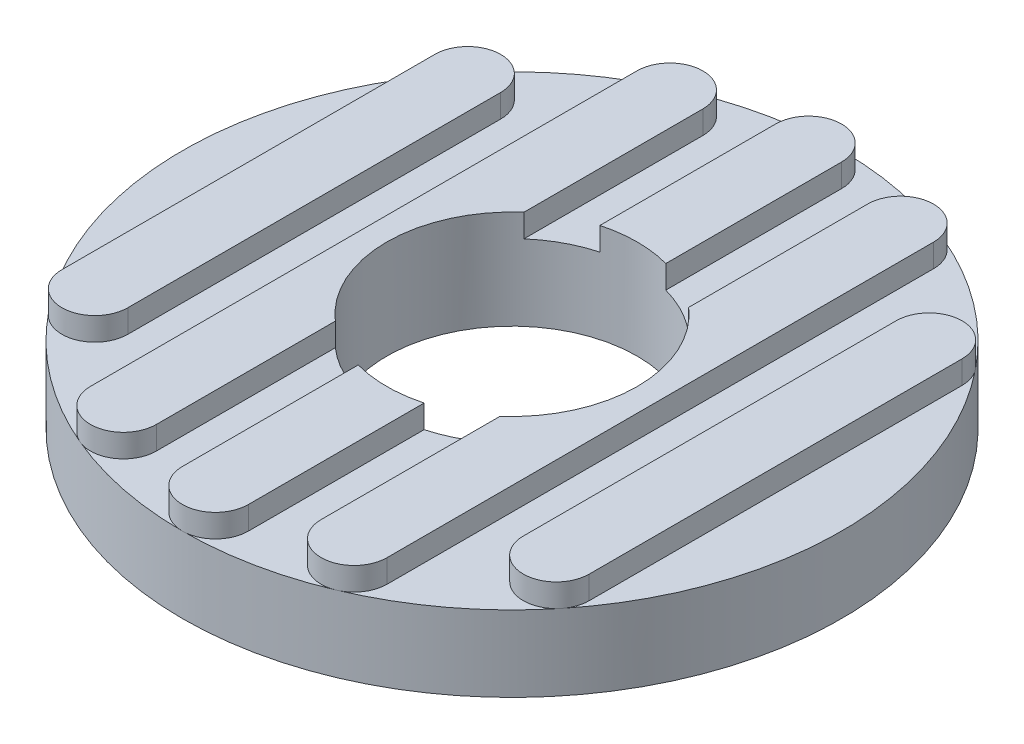
ISO-10303-21;
HEADER;
FILE_DESCRIPTION(('STEP AP214'),'2;1');
FILE_NAME('part.step','',(''),(''),'','','');
FILE_SCHEMA(('AUTOMOTIVE_DESIGN { 1 0 10303 214 1 1 1 1 }'));
ENDSEC;
DATA;
#1=APPLICATION_CONTEXT('core data for automotive mechanical design processes');
#2=APPLICATION_PROTOCOL_DEFINITION('international standard','automotive_design',2000,#1);
#3=PRODUCT_CONTEXT('',#1,'mechanical');
#4=PRODUCT('Part','Part','',(#3));
#5=PRODUCT_RELATED_PRODUCT_CATEGORY('part','',(#4));
#6=PRODUCT_DEFINITION_FORMATION('','',#4);
#7=PRODUCT_DEFINITION_CONTEXT('part definition',#1,'design');
#8=PRODUCT_DEFINITION('design','',#6,#7);
#9=PRODUCT_DEFINITION_SHAPE('','',#8);
#10=(LENGTH_UNIT() NAMED_UNIT(*) SI_UNIT(.MILLI.,.METRE.));
#11=(NAMED_UNIT(*) PLANE_ANGLE_UNIT() SI_UNIT($,.RADIAN.));
#12=(NAMED_UNIT(*) SI_UNIT($,.STERADIAN.) SOLID_ANGLE_UNIT());
#13=UNCERTAINTY_MEASURE_WITH_UNIT(LENGTH_MEASURE(1.E-05),#10,'distance_accuracy_value','');
#14=(GEOMETRIC_REPRESENTATION_CONTEXT(3) GLOBAL_UNCERTAINTY_ASSIGNED_CONTEXT((#13)) GLOBAL_UNIT_ASSIGNED_CONTEXT((#10,
#11,#12)) REPRESENTATION_CONTEXT('',''));
#15=CARTESIAN_POINT('',(0.,0.,0.));
#16=DIRECTION('',(0.,0.,1.));
#17=DIRECTION('',(1.,0.,0.));
#18=AXIS2_PLACEMENT_3D('',#15,#16,#17);
#19=CARTESIAN_POINT('',(0.,2.3,0.));
#20=DIRECTION('',(0.,1.,0.));
#21=DIRECTION('',(0.,0.,1.));
#22=AXIS2_PLACEMENT_3D('',#19,#20,#21);
#23=PLANE('',#22);
#24=CARTESIAN_POINT('',(0.,2.3,0.));
#25=DIRECTION('',(0.,1.,0.));
#26=DIRECTION('',(0.,0.,1.));
#27=AXIS2_PLACEMENT_3D('',#24,#25,#26);
#28=CIRCLE('',#27,3.8);
#29=CARTESIAN_POINT('',(1.,2.3,3.66606055596467));
#30=VERTEX_POINT('',#29);
#31=CARTESIAN_POINT('',(2.5,2.3,2.86181760425083));
#32=VERTEX_POINT('',#31);
#33=EDGE_CURVE('E348',#30,#32,#28,.T.);
#34=ORIENTED_EDGE('',*,*,#33,.F.);
#35=DIRECTION('',(0.,0.,-1.));
#36=VECTOR('',#35,1.);
#37=CARTESIAN_POINT('',(1.,2.3,9.));
#38=LINE('',#37,#36);
#39=CARTESIAN_POINT('',(1.,2.3,9.));
#40=VERTEX_POINT('',#39);
#41=EDGE_CURVE('E276',#40,#30,#38,.T.);
#42=ORIENTED_EDGE('',*,*,#41,.F.);
#43=CARTESIAN_POINT('',(0.,2.3,9.));
#44=DIRECTION('',(0.,1.,0.));
#45=DIRECTION('',(0.,0.,1.));
#46=AXIS2_PLACEMENT_3D('',#43,#44,#45);
#47=CIRCLE('',#46,1.);
#48=CARTESIAN_POINT('',(0.,2.3,10.));
#49=VERTEX_POINT('',#48);
#50=EDGE_CURVE('E275',#49,#40,#47,.T.);
#51=ORIENTED_EDGE('',*,*,#50,.F.);
#52=CARTESIAN_POINT('',(0.,2.3,0.));
#53=DIRECTION('',(0.,1.,0.));
#54=DIRECTION('',(0.,0.,1.));
#55=AXIS2_PLACEMENT_3D('',#52,#53,#54);
#56=CIRCLE('',#55,10.);
#57=CARTESIAN_POINT('',(3.88888888888889,2.3,9.21284663987611));
#58=VERTEX_POINT('',#57);
#59=EDGE_CURVE('E296',#49,#58,#56,.T.);
#60=ORIENTED_EDGE('',*,*,#59,.T.);
#61=CARTESIAN_POINT('',(3.5,2.3,8.2915619758885));
#62=DIRECTION('',(0.,1.,0.));
#63=DIRECTION('',(0.,0.,1.));
#64=AXIS2_PLACEMENT_3D('',#61,#62,#63);
#65=CIRCLE('',#64,1.);
#66=CARTESIAN_POINT('',(2.5,2.3,8.2915619758885));
#67=VERTEX_POINT('',#66);
#68=EDGE_CURVE('E427',#67,#58,#65,.T.);
#69=ORIENTED_EDGE('',*,*,#68,.F.);
#70=DIRECTION('',(0.,0.,1.));
#71=VECTOR('',#70,1.);
#72=CARTESIAN_POINT('',(2.5,2.3,8.2915619758885));
#73=LINE('',#72,#71);
#74=EDGE_CURVE('E434',#32,#67,#73,.T.);
#75=ORIENTED_EDGE('',*,*,#74,.F.);
#76=EDGE_LOOP('',(#34,#42,#51,#60,#69,#75));
#77=FACE_BOUND('',#76,.T.);
#78=ADVANCED_FACE('F17',(#77),#23,.T.);
#79=CARTESIAN_POINT('',(0.,2.3,0.));
#80=DIRECTION('',(0.,1.,0.));
#81=DIRECTION('',(0.,0.,1.));
#82=AXIS2_PLACEMENT_3D('',#79,#80,#81);
#83=CIRCLE('',#82,3.8);
#84=CARTESIAN_POINT('',(-1.,2.3,-3.66606055596467));
#85=VERTEX_POINT('',#84);
#86=CARTESIAN_POINT('',(-2.5,2.3,-2.86181760425083));
#87=VERTEX_POINT('',#86);
#88=EDGE_CURVE('E325',#85,#87,#83,.T.);
#89=ORIENTED_EDGE('',*,*,#88,.F.);
#90=DIRECTION('',(0.,0.,1.));
#91=VECTOR('',#90,1.);
#92=CARTESIAN_POINT('',(-1.,2.3,9.));
#93=LINE('',#92,#91);
#94=CARTESIAN_POINT('',(-1.,2.3,-9.));
#95=VERTEX_POINT('',#94);
#96=EDGE_CURVE('E262',#95,#85,#93,.T.);
#97=ORIENTED_EDGE('',*,*,#96,.F.);
#98=CARTESIAN_POINT('',(0.,2.3,-9.));
#99=DIRECTION('',(0.,1.,0.));
#100=DIRECTION('',(0.,0.,1.));
#101=AXIS2_PLACEMENT_3D('',#98,#99,#100);
#102=CIRCLE('',#101,1.);
#103=CARTESIAN_POINT('',(0.,2.3,-10.));
#104=VERTEX_POINT('',#103);
#105=EDGE_CURVE('E283',#104,#95,#102,.T.);
#106=ORIENTED_EDGE('',*,*,#105,.F.);
#107=CARTESIAN_POINT('',(-3.88888888888889,2.3,-9.21284663987611));
#108=VERTEX_POINT('',#107);
#109=EDGE_CURVE('E301',#104,#108,#56,.T.);
#110=ORIENTED_EDGE('',*,*,#109,.T.);
#111=CARTESIAN_POINT('',(-3.5,2.3,-8.2915619758885));
#112=DIRECTION('',(0.,1.,0.));
#113=DIRECTION('',(0.,0.,-1.));
#114=AXIS2_PLACEMENT_3D('',#111,#112,#113);
#115=CIRCLE('',#114,1.);
#116=CARTESIAN_POINT('',(-2.5,2.3,-8.2915619758885));
#117=VERTEX_POINT('',#116);
#118=EDGE_CURVE('E371',#117,#108,#115,.T.);
#119=ORIENTED_EDGE('',*,*,#118,.F.);
#120=DIRECTION('',(0.,0.,-1.));
#121=VECTOR('',#120,1.);
#122=CARTESIAN_POINT('',(-2.5,2.3,8.2915619758885));
#123=LINE('',#122,#121);
#124=EDGE_CURVE('E367',#87,#117,#123,.T.);
#125=ORIENTED_EDGE('',*,*,#124,.F.);
#126=EDGE_LOOP('',(#89,#97,#106,#110,#119,#125));
#127=FACE_BOUND('',#126,.T.);
#128=ADVANCED_FACE('F529',(#127),#23,.T.);
#129=CARTESIAN_POINT('',(1.,3.,9.));
#130=DIRECTION('',(-1.,0.,0.));
#131=DIRECTION('',(0.,0.,1.));
#132=AXIS2_PLACEMENT_3D('',#129,#130,#131);
#133=PLANE('',#132);
#134=DIRECTION('',(0.,0.,-1.));
#135=VECTOR('',#134,1.);
#136=CARTESIAN_POINT('',(1.,3.,9.));
#137=LINE('',#136,#135);
#138=CARTESIAN_POINT('',(1.,3.,-3.66606055596467));
#139=VERTEX_POINT('',#138);
#140=CARTESIAN_POINT('',(1.,3.,-9.));
#141=VERTEX_POINT('',#140);
#142=EDGE_CURVE('E244',#139,#141,#137,.T.);
#143=ORIENTED_EDGE('',*,*,#142,.F.);
#144=DIRECTION('',(0.,-1.,0.));
#145=VECTOR('',#144,1.);
#146=CARTESIAN_POINT('',(1.,0.,-3.66606055596467));
#147=LINE('',#146,#145);
#148=CARTESIAN_POINT('',(1.,2.3,-3.66606055596467));
#149=VERTEX_POINT('',#148);
#150=EDGE_CURVE('E229',#139,#149,#147,.T.);
#151=ORIENTED_EDGE('',*,*,#150,.T.);
#152=CARTESIAN_POINT('',(1.,2.3,-9.));
#153=VERTEX_POINT('',#152);
#154=EDGE_CURVE('E273',#149,#153,#38,.T.);
#155=ORIENTED_EDGE('',*,*,#154,.T.);
#156=DIRECTION('',(0.,-1.,0.));
#157=VECTOR('',#156,1.);
#158=CARTESIAN_POINT('',(1.,3.,-9.));
#159=LINE('',#158,#157);
#160=EDGE_CURVE('E254',#141,#153,#159,.T.);
#161=ORIENTED_EDGE('',*,*,#160,.F.);
#162=EDGE_LOOP('',(#143,#151,#155,#161));
#163=FACE_BOUND('',#162,.T.);
#164=ADVANCED_FACE('F252',(#163),#133,.F.);
#165=CARTESIAN_POINT('',(-1.,3.,9.));
#166=DIRECTION('',(1.,0.,0.));
#167=DIRECTION('',(0.,0.,-1.));
#168=AXIS2_PLACEMENT_3D('',#165,#166,#167);
#169=PLANE('',#168);
#170=DIRECTION('',(0.,0.,1.));
#171=VECTOR('',#170,1.);
#172=CARTESIAN_POINT('',(-1.,3.,9.));
#173=LINE('',#172,#171);
#174=CARTESIAN_POINT('',(-1.,3.,3.66606055596467));
#175=VERTEX_POINT('',#174);
#176=CARTESIAN_POINT('',(-1.,3.,9.));
#177=VERTEX_POINT('',#176);
#178=EDGE_CURVE('E267',#175,#177,#173,.T.);
#179=ORIENTED_EDGE('',*,*,#178,.F.);
#180=DIRECTION('',(0.,-1.,0.));
#181=VECTOR('',#180,1.);
#182=CARTESIAN_POINT('',(-1.,0.,3.66606055596467));
#183=LINE('',#182,#181);
#184=CARTESIAN_POINT('',(-1.,2.3,3.66606055596467));
#185=VERTEX_POINT('',#184);
#186=EDGE_CURVE('E324',#175,#185,#183,.T.);
#187=ORIENTED_EDGE('',*,*,#186,.T.);
#188=CARTESIAN_POINT('',(-1.,2.3,9.));
#189=VERTEX_POINT('',#188);
#190=EDGE_CURVE('E282',#185,#189,#93,.T.);
#191=ORIENTED_EDGE('',*,*,#190,.T.);
#192=DIRECTION('',(0.,-1.,0.));
#193=VECTOR('',#192,1.);
#194=CARTESIAN_POINT('',(-1.,3.,9.));
#195=LINE('',#194,#193);
#196=EDGE_CURVE('E269',#177,#189,#195,.T.);
#197=ORIENTED_EDGE('',*,*,#196,.F.);
#198=EDGE_LOOP('',(#179,#187,#191,#197));
#199=FACE_BOUND('',#198,.T.);
#200=ADVANCED_FACE('F334',(#199),#169,.F.);
#201=CARTESIAN_POINT('',(0.,3.,9.));
#202=DIRECTION('',(0.,1.,0.));
#203=DIRECTION('',(0.,0.,1.));
#204=AXIS2_PLACEMENT_3D('',#201,#202,#203);
#205=PLANE('',#204);
#206=CARTESIAN_POINT('',(1.,3.,9.));
#207=VERTEX_POINT('',#206);
#208=CARTESIAN_POINT('',(1.,3.,3.66606055596467));
#209=VERTEX_POINT('',#208);
#210=EDGE_CURVE('E256',#207,#209,#137,.T.);
#211=ORIENTED_EDGE('',*,*,#210,.T.);
#212=CARTESIAN_POINT('',(0.,3.,0.));
#213=DIRECTION('',(0.,-1.,0.));
#214=DIRECTION('',(0.,0.,-1.));
#215=AXIS2_PLACEMENT_3D('',#212,#213,#214);
#216=CIRCLE('',#215,3.8);
#217=EDGE_CURVE('E248',#209,#175,#216,.T.);
#218=ORIENTED_EDGE('',*,*,#217,.T.);
#219=ORIENTED_EDGE('',*,*,#178,.T.);
#220=CARTESIAN_POINT('',(0.,3.,9.));
#221=DIRECTION('',(0.,1.,0.));
#222=DIRECTION('',(0.,0.,1.));
#223=AXIS2_PLACEMENT_3D('',#220,#221,#222);
#224=CIRCLE('',#223,1.);
#225=EDGE_CURVE('E257',#177,#207,#224,.T.);
#226=ORIENTED_EDGE('',*,*,#225,.T.);
#227=EDGE_LOOP('',(#211,#218,#219,#226));
#228=FACE_BOUND('',#227,.T.);
#229=ADVANCED_FACE('F329',(#228),#205,.T.);
#230=CARTESIAN_POINT('',(-1.,3.,-9.));
#231=VERTEX_POINT('',#230);
#232=CARTESIAN_POINT('',(-1.,3.,-3.66606055596467));
#233=VERTEX_POINT('',#232);
#234=EDGE_CURVE('E247',#231,#233,#173,.T.);
#235=ORIENTED_EDGE('',*,*,#234,.T.);
#236=EDGE_CURVE('E232',#233,#139,#216,.T.);
#237=ORIENTED_EDGE('',*,*,#236,.T.);
#238=ORIENTED_EDGE('',*,*,#142,.T.);
#239=CARTESIAN_POINT('',(0.,3.,-9.));
#240=DIRECTION('',(0.,1.,0.));
#241=DIRECTION('',(0.,0.,1.));
#242=AXIS2_PLACEMENT_3D('',#239,#240,#241);
#243=CIRCLE('',#242,1.);
#244=EDGE_CURVE('E260',#141,#231,#243,.T.);
#245=ORIENTED_EDGE('',*,*,#244,.T.);
#246=EDGE_LOOP('',(#235,#237,#238,#245));
#247=FACE_BOUND('',#246,.T.);
#248=ADVANCED_FACE('F243',(#247),#205,.T.);
#249=CARTESIAN_POINT('',(3.5,3.,8.2915619758885));
#250=DIRECTION('',(0.,1.,0.));
#251=DIRECTION('',(0.,0.,1.));
#252=AXIS2_PLACEMENT_3D('',#249,#250,#251);
#253=PLANE('',#252);
#254=DIRECTION('',(0.,0.,1.));
#255=VECTOR('',#254,1.);
#256=CARTESIAN_POINT('',(2.5,3.,8.2915619758885));
#257=LINE('',#256,#255);
#258=CARTESIAN_POINT('',(2.5,3.,-8.2915619758885));
#259=VERTEX_POINT('',#258);
#260=CARTESIAN_POINT('',(2.5,3.,-2.86181760425083));
#261=VERTEX_POINT('',#260);
#262=EDGE_CURVE('E424',#259,#261,#257,.T.);
#263=ORIENTED_EDGE('',*,*,#262,.T.);
#264=CARTESIAN_POINT('',(2.5,3.,2.86181760425083));
#265=VERTEX_POINT('',#264);
#266=EDGE_CURVE('E314',#261,#265,#216,.T.);
#267=ORIENTED_EDGE('',*,*,#266,.T.);
#268=CARTESIAN_POINT('',(2.5,3.,8.2915619758885));
#269=VERTEX_POINT('',#268);
#270=EDGE_CURVE('E423',#265,#269,#257,.T.);
#271=ORIENTED_EDGE('',*,*,#270,.T.);
#272=CARTESIAN_POINT('',(3.5,3.,8.2915619758885));
#273=DIRECTION('',(0.,1.,0.));
#274=DIRECTION('',(0.,0.,1.));
#275=AXIS2_PLACEMENT_3D('',#272,#273,#274);
#276=CIRCLE('',#275,1.);
#277=CARTESIAN_POINT('',(4.5,3.,8.2915619758885));
#278=VERTEX_POINT('',#277);
#279=EDGE_CURVE('E415',#269,#278,#276,.T.);
#280=ORIENTED_EDGE('',*,*,#279,.T.);
#281=DIRECTION('',(0.,0.,-1.));
#282=VECTOR('',#281,1.);
#283=CARTESIAN_POINT('',(4.5,3.,8.2915619758885));
#284=LINE('',#283,#282);
#285=CARTESIAN_POINT('',(4.5,3.,-8.2915619758885));
#286=VERTEX_POINT('',#285);
#287=EDGE_CURVE('E418',#278,#286,#284,.T.);
#288=ORIENTED_EDGE('',*,*,#287,.T.);
#289=CARTESIAN_POINT('',(3.5,3.,-8.2915619758885));
#290=DIRECTION('',(0.,1.,0.));
#291=DIRECTION('',(0.,0.,1.));
#292=AXIS2_PLACEMENT_3D('',#289,#290,#291);
#293=CIRCLE('',#292,1.);
#294=EDGE_CURVE('E421',#286,#259,#293,.T.);
#295=ORIENTED_EDGE('',*,*,#294,.T.);
#296=EDGE_LOOP('',(#263,#267,#271,#280,#288,#295));
#297=FACE_BOUND('',#296,.T.);
#298=ADVANCED_FACE('F615',(#297),#253,.T.);
#299=CARTESIAN_POINT('',(2.5,3.,8.2915619758885));
#300=DIRECTION('',(1.,0.,0.));
#301=DIRECTION('',(0.,0.,-1.));
#302=AXIS2_PLACEMENT_3D('',#299,#300,#301);
#303=PLANE('',#302);
#304=ORIENTED_EDGE('',*,*,#270,.F.);
#305=DIRECTION('',(0.,-1.,0.));
#306=VECTOR('',#305,1.);
#307=CARTESIAN_POINT('',(2.5,0.,2.86181760425083));
#308=LINE('',#307,#306);
#309=EDGE_CURVE('E239',#265,#32,#308,.T.);
#310=ORIENTED_EDGE('',*,*,#309,.T.);
#311=ORIENTED_EDGE('',*,*,#74,.T.);
#312=DIRECTION('',(0.,-1.,0.));
#313=VECTOR('',#312,1.);
#314=CARTESIAN_POINT('',(2.5,3.,8.2915619758885));
#315=LINE('',#314,#313);
#316=EDGE_CURVE('E426',#269,#67,#315,.T.);
#317=ORIENTED_EDGE('',*,*,#316,.F.);
#318=EDGE_LOOP('',(#304,#310,#311,#317));
#319=FACE_BOUND('',#318,.T.);
#320=ADVANCED_FACE('F612',(#319),#303,.F.);
#321=CARTESIAN_POINT('',(-2.5,3.,8.2915619758885));
#322=DIRECTION('',(-1.,0.,0.));
#323=DIRECTION('',(0.,0.,1.));
#324=AXIS2_PLACEMENT_3D('',#321,#322,#323);
#325=PLANE('',#324);
#326=DIRECTION('',(0.,0.,-1.));
#327=VECTOR('',#326,1.);
#328=CARTESIAN_POINT('',(-2.5,3.,8.2915619758885));
#329=LINE('',#328,#327);
#330=CARTESIAN_POINT('',(-2.5,3.,-2.86181760425083));
#331=VERTEX_POINT('',#330);
#332=CARTESIAN_POINT('',(-2.5,3.,-8.2915619758885));
#333=VERTEX_POINT('',#332);
#334=EDGE_CURVE('E358',#331,#333,#329,.T.);
#335=ORIENTED_EDGE('',*,*,#334,.F.);
#336=DIRECTION('',(0.,-1.,0.));
#337=VECTOR('',#336,1.);
#338=CARTESIAN_POINT('',(-2.5,0.,-2.86181760425083));
#339=LINE('',#338,#337);
#340=EDGE_CURVE('E11',#331,#87,#339,.T.);
#341=ORIENTED_EDGE('',*,*,#340,.T.);
#342=ORIENTED_EDGE('',*,*,#124,.T.);
#343=DIRECTION('',(0.,-1.,0.));
#344=VECTOR('',#343,1.);
#345=CARTESIAN_POINT('',(-2.5,3.,-8.2915619758885));
#346=LINE('',#345,#344);
#347=EDGE_CURVE('E377',#333,#117,#346,.T.);
#348=ORIENTED_EDGE('',*,*,#347,.F.);
#349=EDGE_LOOP('',(#335,#341,#342,#348));
#350=FACE_BOUND('',#349,.T.);
#351=ADVANCED_FACE('F581',(#350),#325,.F.);
#352=CARTESIAN_POINT('',(-2.5,2.3,2.86181760425084));
#353=VERTEX_POINT('',#352);
#354=EDGE_CURVE('E320',#353,#185,#83,.T.);
#355=ORIENTED_EDGE('',*,*,#354,.F.);
#356=CARTESIAN_POINT('',(-2.5,2.3,8.2915619758885));
#357=VERTEX_POINT('',#356);
#358=EDGE_CURVE('E368',#357,#353,#123,.T.);
#359=ORIENTED_EDGE('',*,*,#358,.F.);
#360=CARTESIAN_POINT('',(-3.5,2.3,8.2915619758885));
#361=DIRECTION('',(0.,1.,0.));
#362=DIRECTION('',(0.,0.,-1.));
#363=AXIS2_PLACEMENT_3D('',#360,#361,#362);
#364=CIRCLE('',#363,1.);
#365=CARTESIAN_POINT('',(-3.88888888888888,2.3,9.21284663987611));
#366=VERTEX_POINT('',#365);
#367=EDGE_CURVE('E347',#366,#357,#364,.T.);
#368=ORIENTED_EDGE('',*,*,#367,.F.);
#369=EDGE_CURVE('E304',#366,#49,#56,.T.);
#370=ORIENTED_EDGE('',*,*,#369,.T.);
#371=EDGE_CURVE('E270',#189,#49,#47,.T.);
#372=ORIENTED_EDGE('',*,*,#371,.F.);
#373=ORIENTED_EDGE('',*,*,#190,.F.);
#374=EDGE_LOOP('',(#355,#359,#368,#370,#372,#373));
#375=FACE_BOUND('',#374,.T.);
#376=ADVANCED_FACE('F536',(#375),#23,.T.);
#377=CARTESIAN_POINT('',(-7.77777777777777,2.3,6.28539361054709));
#378=VERTEX_POINT('',#377);
#379=EDGE_CURVE('E607',#378,#366,#56,.T.);
#380=ORIENTED_EDGE('',*,*,#379,.T.);
#381=CARTESIAN_POINT('',(-4.5,2.3,8.2915619758885));
#382=VERTEX_POINT('',#381);
#383=EDGE_CURVE('E350',#382,#366,#364,.T.);
#384=ORIENTED_EDGE('',*,*,#383,.F.);
#385=DIRECTION('',(0.,0.,1.));
#386=VECTOR('',#385,1.);
#387=CARTESIAN_POINT('',(-4.5,2.3,8.2915619758885));
#388=LINE('',#387,#386);
#389=CARTESIAN_POINT('',(-4.5,2.3,-8.2915619758885));
#390=VERTEX_POINT('',#389);
#391=EDGE_CURVE('E359',#390,#382,#388,.T.);
#392=ORIENTED_EDGE('',*,*,#391,.F.);
#393=EDGE_CURVE('E370',#108,#390,#115,.T.);
#394=ORIENTED_EDGE('',*,*,#393,.F.);
#395=CARTESIAN_POINT('',(-7.77777777777778,2.3,-6.28539361054709));
#396=VERTEX_POINT('',#395);
#397=EDGE_CURVE('E300',#108,#396,#56,.T.);
#398=ORIENTED_EDGE('',*,*,#397,.T.);
#399=CARTESIAN_POINT('',(-7.,2.3,-5.65685424949238));
#400=DIRECTION('',(0.,1.,0.));
#401=DIRECTION('',(0.,0.,-1.));
#402=AXIS2_PLACEMENT_3D('',#399,#400,#401);
#403=CIRCLE('',#402,1.);
#404=CARTESIAN_POINT('',(-6.,2.3,-5.65685424949238));
#405=VERTEX_POINT('',#404);
#406=EDGE_CURVE('E400',#405,#396,#403,.T.);
#407=ORIENTED_EDGE('',*,*,#406,.F.);
#408=DIRECTION('',(0.,0.,-1.));
#409=VECTOR('',#408,1.);
#410=CARTESIAN_POINT('',(-6.,2.3,5.65685424949238));
#411=LINE('',#410,#409);
#412=CARTESIAN_POINT('',(-6.,2.3,5.65685424949238));
#413=VERTEX_POINT('',#412);
#414=EDGE_CURVE('E397',#413,#405,#411,.T.);
#415=ORIENTED_EDGE('',*,*,#414,.F.);
#416=CARTESIAN_POINT('',(-7.,2.3,5.65685424949238));
#417=DIRECTION('',(0.,1.,0.));
#418=DIRECTION('',(0.,0.,-1.));
#419=AXIS2_PLACEMENT_3D('',#416,#417,#418);
#420=CIRCLE('',#419,1.);
#421=EDGE_CURVE('E383',#378,#413,#420,.T.);
#422=ORIENTED_EDGE('',*,*,#421,.F.);
#423=EDGE_LOOP('',(#380,#384,#392,#394,#398,#407,#415,#422));
#424=FACE_BOUND('',#423,.T.);
#425=ADVANCED_FACE('F590',(#424),#23,.T.);
#426=EDGE_CURVE('E506',#396,#378,#56,.T.);
#427=ORIENTED_EDGE('',*,*,#426,.T.);
#428=CARTESIAN_POINT('',(-8.,2.3,5.65685424949238));
#429=VERTEX_POINT('',#428);
#430=EDGE_CURVE('E395',#429,#378,#420,.T.);
#431=ORIENTED_EDGE('',*,*,#430,.F.);
#432=DIRECTION('',(0.,0.,1.));
#433=VECTOR('',#432,1.);
#434=CARTESIAN_POINT('',(-8.,2.3,5.65685424949238));
#435=LINE('',#434,#433);
#436=CARTESIAN_POINT('',(-8.,2.3,-5.65685424949238));
#437=VERTEX_POINT('',#436);
#438=EDGE_CURVE('E388',#437,#429,#435,.T.);
#439=ORIENTED_EDGE('',*,*,#438,.F.);
#440=EDGE_CURVE('E399',#396,#437,#403,.T.);
#441=ORIENTED_EDGE('',*,*,#440,.F.);
#442=EDGE_LOOP('',(#427,#431,#439,#441));
#443=FACE_BOUND('',#442,.T.);
#444=ADVANCED_FACE('F549',(#443),#23,.T.);
#445=CARTESIAN_POINT('',(3.5,2.3,-8.2915619758885));
#446=DIRECTION('',(0.,1.,0.));
#447=DIRECTION('',(0.,0.,1.));
#448=AXIS2_PLACEMENT_3D('',#445,#446,#447);
#449=CIRCLE('',#448,1.);
#450=CARTESIAN_POINT('',(4.5,2.3,-8.2915619758885));
#451=VERTEX_POINT('',#450);
#452=CARTESIAN_POINT('',(3.88888888888889,2.3,-9.21284663987611));
#453=VERTEX_POINT('',#452);
#454=EDGE_CURVE('E432',#451,#453,#449,.T.);
#455=ORIENTED_EDGE('',*,*,#454,.F.);
#456=DIRECTION('',(0.,0.,-1.));
#457=VECTOR('',#456,1.);
#458=CARTESIAN_POINT('',(4.5,2.3,8.2915619758885));
#459=LINE('',#458,#457);
#460=CARTESIAN_POINT('',(4.5,2.3,8.2915619758885));
#461=VERTEX_POINT('',#460);
#462=EDGE_CURVE('E429',#461,#451,#459,.T.);
#463=ORIENTED_EDGE('',*,*,#462,.F.);
#464=EDGE_CURVE('E414',#58,#461,#65,.T.);
#465=ORIENTED_EDGE('',*,*,#464,.F.);
#466=CARTESIAN_POINT('',(7.77777777777778,2.3,6.28539361054709));
#467=VERTEX_POINT('',#466);
#468=EDGE_CURVE('E299',#58,#467,#56,.T.);
#469=ORIENTED_EDGE('',*,*,#468,.T.);
#470=CARTESIAN_POINT('',(7.,2.3,5.65685424949238));
#471=DIRECTION('',(0.,1.,0.));
#472=DIRECTION('',(0.,0.,1.));
#473=AXIS2_PLACEMENT_3D('',#470,#471,#472);
#474=CIRCLE('',#473,1.);
#475=CARTESIAN_POINT('',(6.,2.3,5.65685424949238));
#476=VERTEX_POINT('',#475);
#477=EDGE_CURVE('E447',#476,#467,#474,.T.);
#478=ORIENTED_EDGE('',*,*,#477,.F.);
#479=DIRECTION('',(0.,0.,1.));
#480=VECTOR('',#479,1.);
#481=CARTESIAN_POINT('',(6.,2.3,5.65685424949238));
#482=LINE('',#481,#480);
#483=CARTESIAN_POINT('',(6.,2.3,-5.65685424949238));
#484=VERTEX_POINT('',#483);
#485=EDGE_CURVE('E452',#484,#476,#482,.T.);
#486=ORIENTED_EDGE('',*,*,#485,.F.);
#487=CARTESIAN_POINT('',(7.,2.3,-5.65685424949238));
#488=DIRECTION('',(0.,1.,0.));
#489=DIRECTION('',(0.,0.,1.));
#490=AXIS2_PLACEMENT_3D('',#487,#488,#489);
#491=CIRCLE('',#490,1.);
#492=CARTESIAN_POINT('',(7.77777777777778,2.3,-6.28539361054709));
#493=VERTEX_POINT('',#492);
#494=EDGE_CURVE('E305',#484,#493,#491,.F.);
#495=ORIENTED_EDGE('',*,*,#494,.T.);
#496=EDGE_CURVE('E497',#493,#453,#56,.T.);
#497=ORIENTED_EDGE('',*,*,#496,.T.);
#498=EDGE_LOOP('',(#455,#463,#465,#469,#478,#486,#495,#497));
#499=FACE_BOUND('',#498,.T.);
#500=ADVANCED_FACE('F496',(#499),#23,.T.);
#501=CARTESIAN_POINT('',(2.5,2.3,-2.86181760425083));
#502=VERTEX_POINT('',#501);
#503=EDGE_CURVE('E235',#502,#149,#28,.T.);
#504=ORIENTED_EDGE('',*,*,#503,.F.);
#505=CARTESIAN_POINT('',(2.5,2.3,-8.2915619758885));
#506=VERTEX_POINT('',#505);
#507=EDGE_CURVE('E419',#506,#502,#73,.T.);
#508=ORIENTED_EDGE('',*,*,#507,.F.);
#509=EDGE_CURVE('E431',#453,#506,#449,.T.);
#510=ORIENTED_EDGE('',*,*,#509,.F.);
#511=EDGE_CURVE('E505',#453,#104,#56,.T.);
#512=ORIENTED_EDGE('',*,*,#511,.T.);
#513=EDGE_CURVE('E279',#153,#104,#102,.T.);
#514=ORIENTED_EDGE('',*,*,#513,.F.);
#515=ORIENTED_EDGE('',*,*,#154,.F.);
#516=EDGE_LOOP('',(#504,#508,#510,#512,#514,#515));
#517=FACE_BOUND('',#516,.T.);
#518=ADVANCED_FACE('F539',(#517),#23,.T.);
#519=CARTESIAN_POINT('',(7.,2.3,-5.65685424949238));
#520=DIRECTION('',(0.,1.,0.));
#521=DIRECTION('',(0.,0.,1.));
#522=AXIS2_PLACEMENT_3D('',#519,#520,#521);
#523=CIRCLE('',#522,1.);
#524=CARTESIAN_POINT('',(8.,2.3,-5.65685424949238));
#525=VERTEX_POINT('',#524);
#526=EDGE_CURVE('E463',#525,#493,#523,.T.);
#527=ORIENTED_EDGE('',*,*,#526,.F.);
#528=DIRECTION('',(0.,0.,-1.));
#529=VECTOR('',#528,1.);
#530=CARTESIAN_POINT('',(8.,2.3,5.65685424949238));
#531=LINE('',#530,#529);
#532=CARTESIAN_POINT('',(8.,2.3,5.65685424949238));
#533=VERTEX_POINT('',#532);
#534=EDGE_CURVE('E461',#533,#525,#531,.T.);
#535=ORIENTED_EDGE('',*,*,#534,.F.);
#536=CARTESIAN_POINT('',(7.,2.3,5.65685424949238));
#537=DIRECTION('',(0.,1.,0.));
#538=DIRECTION('',(0.,0.,1.));
#539=AXIS2_PLACEMENT_3D('',#536,#537,#538);
#540=CIRCLE('',#539,1.);
#541=EDGE_CURVE('E308',#533,#467,#540,.F.);
#542=ORIENTED_EDGE('',*,*,#541,.T.);
#543=EDGE_CURVE('E485',#467,#493,#56,.T.);
#544=ORIENTED_EDGE('',*,*,#543,.T.);
#545=EDGE_LOOP('',(#527,#535,#542,#544));
#546=FACE_BOUND('',#545,.T.);
#547=ADVANCED_FACE('F482',(#546),#23,.T.);
#548=CARTESIAN_POINT('',(0.,2.3,0.));
#549=DIRECTION('',(0.,-1.,0.));
#550=DIRECTION('',(0.,0.,-1.));
#551=AXIS2_PLACEMENT_3D('',#548,#549,#550);
#552=CYLINDRICAL_SURFACE('',#551,10.);
#553=ORIENTED_EDGE('',*,*,#59,.F.);
#554=ORIENTED_EDGE('',*,*,#369,.F.);
#555=ORIENTED_EDGE('',*,*,#379,.F.);
#556=ORIENTED_EDGE('',*,*,#426,.F.);
#557=ORIENTED_EDGE('',*,*,#397,.F.);
#558=ORIENTED_EDGE('',*,*,#109,.F.);
#559=ORIENTED_EDGE('',*,*,#511,.F.);
#560=ORIENTED_EDGE('',*,*,#496,.F.);
#561=ORIENTED_EDGE('',*,*,#543,.F.);
#562=ORIENTED_EDGE('',*,*,#468,.F.);
#563=EDGE_LOOP('',(#553,#554,#555,#556,#557,#558,#559,#560,#561,#562));
#564=FACE_BOUND('',#563,.T.);
#565=CARTESIAN_POINT('',(0.,0.,0.));
#566=DIRECTION('',(0.,1.,0.));
#567=DIRECTION('',(0.,0.,1.));
#568=AXIS2_PLACEMENT_3D('',#565,#566,#567);
#569=CIRCLE('',#568,10.);
#570=CARTESIAN_POINT('',(0.,0.,10.));
#571=VERTEX_POINT('',#570);
#572=EDGE_CURVE('E295',#571,#571,#569,.T.);
#573=ORIENTED_EDGE('',*,*,#572,.T.);
#574=EDGE_LOOP('',(#573));
#575=FACE_BOUND('',#574,.T.);
#576=ADVANCED_FACE('F19',(#564,#575),#552,.T.);
#577=CARTESIAN_POINT('',(0.,0.,0.));
#578=DIRECTION('',(0.,1.,0.));
#579=DIRECTION('',(0.,0.,1.));
#580=AXIS2_PLACEMENT_3D('',#577,#578,#579);
#581=PLANE('',#580);
#582=CARTESIAN_POINT('',(0.,0.,0.));
#583=DIRECTION('',(0.,-1.,0.));
#584=DIRECTION('',(0.,0.,-1.));
#585=AXIS2_PLACEMENT_3D('',#582,#583,#584);
#586=CIRCLE('',#585,3.8);
#587=CARTESIAN_POINT('',(0.,0.,-3.8));
#588=VERTEX_POINT('',#587);
#589=EDGE_CURVE('E249',#588,#588,#586,.T.);
#590=ORIENTED_EDGE('',*,*,#589,.F.);
#591=EDGE_LOOP('',(#590));
#592=FACE_BOUND('',#591,.T.);
#593=ORIENTED_EDGE('',*,*,#572,.F.);
#594=EDGE_LOOP('',(#593));
#595=FACE_BOUND('',#594,.T.);
#596=ADVANCED_FACE('F544',(#592,#595),#581,.F.);
#597=CARTESIAN_POINT('',(0.,3.,9.));
#598=DIRECTION('',(0.,-1.,0.));
#599=DIRECTION('',(0.,0.,-1.));
#600=AXIS2_PLACEMENT_3D('',#597,#598,#599);
#601=CYLINDRICAL_SURFACE('',#600,1.);
#602=ORIENTED_EDGE('',*,*,#371,.T.);
#603=ORIENTED_EDGE('',*,*,#50,.T.);
#604=DIRECTION('',(0.,-1.,0.));
#605=VECTOR('',#604,1.);
#606=CARTESIAN_POINT('',(1.,3.,9.));
#607=LINE('',#606,#605);
#608=EDGE_CURVE('E292',#207,#40,#607,.T.);
#609=ORIENTED_EDGE('',*,*,#608,.F.);
#610=ORIENTED_EDGE('',*,*,#225,.F.);
#611=ORIENTED_EDGE('',*,*,#196,.T.);
#612=EDGE_LOOP('',(#602,#603,#609,#610,#611));
#613=FACE_BOUND('',#612,.T.);
#614=ADVANCED_FACE('F340',(#613),#601,.T.);
#615=ORIENTED_EDGE('',*,*,#41,.T.);
#616=DIRECTION('',(0.,-1.,0.));
#617=VECTOR('',#616,1.);
#618=CARTESIAN_POINT('',(1.,0.,3.66606055596467));
#619=LINE('',#618,#617);
#620=EDGE_CURVE('E345',#30,#209,#619,.F.);
#621=ORIENTED_EDGE('',*,*,#620,.T.);
#622=ORIENTED_EDGE('',*,*,#210,.F.);
#623=ORIENTED_EDGE('',*,*,#608,.T.);
#624=EDGE_LOOP('',(#615,#621,#622,#623));
#625=FACE_BOUND('',#624,.T.);
#626=ADVANCED_FACE('F344',(#625),#133,.F.);
#627=CARTESIAN_POINT('',(0.,3.,-9.));
#628=DIRECTION('',(0.,-1.,0.));
#629=DIRECTION('',(0.,0.,-1.));
#630=AXIS2_PLACEMENT_3D('',#627,#628,#629);
#631=CYLINDRICAL_SURFACE('',#630,1.);
#632=ORIENTED_EDGE('',*,*,#513,.T.);
#633=ORIENTED_EDGE('',*,*,#105,.T.);
#634=DIRECTION('',(0.,-1.,0.));
#635=VECTOR('',#634,1.);
#636=CARTESIAN_POINT('',(-1.,3.,-9.));
#637=LINE('',#636,#635);
#638=EDGE_CURVE('E288',#231,#95,#637,.T.);
#639=ORIENTED_EDGE('',*,*,#638,.F.);
#640=ORIENTED_EDGE('',*,*,#244,.F.);
#641=ORIENTED_EDGE('',*,*,#160,.T.);
#642=EDGE_LOOP('',(#632,#633,#639,#640,#641));
#643=FACE_BOUND('',#642,.T.);
#644=ADVANCED_FACE('F572',(#643),#631,.T.);
#645=ORIENTED_EDGE('',*,*,#96,.T.);
#646=DIRECTION('',(0.,-1.,0.));
#647=VECTOR('',#646,1.);
#648=CARTESIAN_POINT('',(-1.,0.,-3.66606055596467));
#649=LINE('',#648,#647);
#650=EDGE_CURVE('E575',#85,#233,#649,.F.);
#651=ORIENTED_EDGE('',*,*,#650,.T.);
#652=ORIENTED_EDGE('',*,*,#234,.F.);
#653=ORIENTED_EDGE('',*,*,#638,.T.);
#654=EDGE_LOOP('',(#645,#651,#652,#653));
#655=FACE_BOUND('',#654,.T.);
#656=ADVANCED_FACE('F574',(#655),#169,.F.);
#657=CARTESIAN_POINT('',(7.,3.,5.65685424949238));
#658=DIRECTION('',(0.,-1.,0.));
#659=DIRECTION('',(0.,0.,-1.));
#660=AXIS2_PLACEMENT_3D('',#657,#658,#659);
#661=CYLINDRICAL_SURFACE('',#660,1.);
#662=ORIENTED_EDGE('',*,*,#477,.T.);
#663=ORIENTED_EDGE('',*,*,#541,.F.);
#664=DIRECTION('',(0.,-1.,0.));
#665=VECTOR('',#664,1.);
#666=CARTESIAN_POINT('',(8.,3.,5.65685424949238));
#667=LINE('',#666,#665);
#668=CARTESIAN_POINT('',(8.,3.,5.65685424949238));
#669=VERTEX_POINT('',#668);
#670=EDGE_CURVE('E274',#669,#533,#667,.T.);
#671=ORIENTED_EDGE('',*,*,#670,.F.);
#672=CARTESIAN_POINT('',(7.,3.,5.65685424949238));
#673=DIRECTION('',(0.,1.,0.));
#674=DIRECTION('',(0.,0.,1.));
#675=AXIS2_PLACEMENT_3D('',#672,#673,#674);
#676=CIRCLE('',#675,1.);
#677=CARTESIAN_POINT('',(6.,3.,5.65685424949238));
#678=VERTEX_POINT('',#677);
#679=EDGE_CURVE('E448',#678,#669,#676,.T.);
#680=ORIENTED_EDGE('',*,*,#679,.F.);
#681=DIRECTION('',(0.,-1.,0.));
#682=VECTOR('',#681,1.);
#683=CARTESIAN_POINT('',(6.,3.,5.65685424949238));
#684=LINE('',#683,#682);
#685=EDGE_CURVE('E458',#678,#476,#684,.T.);
#686=ORIENTED_EDGE('',*,*,#685,.T.);
#687=EDGE_LOOP('',(#662,#663,#671,#680,#686));
#688=FACE_BOUND('',#687,.T.);
#689=ADVANCED_FACE('F509',(#688),#661,.T.);
#690=CARTESIAN_POINT('',(8.,3.,5.65685424949238));
#691=DIRECTION('',(-1.,0.,0.));
#692=DIRECTION('',(0.,0.,1.));
#693=AXIS2_PLACEMENT_3D('',#690,#691,#692);
#694=PLANE('',#693);
#695=ORIENTED_EDGE('',*,*,#534,.T.);
#696=DIRECTION('',(0.,-1.,0.));
#697=VECTOR('',#696,1.);
#698=CARTESIAN_POINT('',(8.,3.,-5.65685424949238));
#699=LINE('',#698,#697);
#700=CARTESIAN_POINT('',(8.,3.,-5.65685424949238));
#701=VERTEX_POINT('',#700);
#702=EDGE_CURVE('E470',#701,#525,#699,.T.);
#703=ORIENTED_EDGE('',*,*,#702,.F.);
#704=DIRECTION('',(0.,0.,-1.));
#705=VECTOR('',#704,1.);
#706=CARTESIAN_POINT('',(8.,3.,5.65685424949238));
#707=LINE('',#706,#705);
#708=EDGE_CURVE('E451',#669,#701,#707,.T.);
#709=ORIENTED_EDGE('',*,*,#708,.F.);
#710=ORIENTED_EDGE('',*,*,#670,.T.);
#711=EDGE_LOOP('',(#695,#703,#709,#710));
#712=FACE_BOUND('',#711,.T.);
#713=ADVANCED_FACE('F476',(#712),#694,.F.);
#714=CARTESIAN_POINT('',(7.,3.,-5.65685424949238));
#715=DIRECTION('',(0.,-1.,0.));
#716=DIRECTION('',(0.,0.,-1.));
#717=AXIS2_PLACEMENT_3D('',#714,#715,#716);
#718=CYLINDRICAL_SURFACE('',#717,1.);
#719=ORIENTED_EDGE('',*,*,#526,.T.);
#720=ORIENTED_EDGE('',*,*,#494,.F.);
#721=DIRECTION('',(0.,-1.,0.));
#722=VECTOR('',#721,1.);
#723=CARTESIAN_POINT('',(6.,3.,-5.65685424949238));
#724=LINE('',#723,#722);
#725=CARTESIAN_POINT('',(6.,3.,-5.65685424949238));
#726=VERTEX_POINT('',#725);
#727=EDGE_CURVE('E468',#726,#484,#724,.T.);
#728=ORIENTED_EDGE('',*,*,#727,.F.);
#729=CARTESIAN_POINT('',(7.,3.,-5.65685424949238));
#730=DIRECTION('',(0.,1.,0.));
#731=DIRECTION('',(0.,0.,1.));
#732=AXIS2_PLACEMENT_3D('',#729,#730,#731);
#733=CIRCLE('',#732,1.);
#734=EDGE_CURVE('E454',#701,#726,#733,.T.);
#735=ORIENTED_EDGE('',*,*,#734,.F.);
#736=ORIENTED_EDGE('',*,*,#702,.T.);
#737=EDGE_LOOP('',(#719,#720,#728,#735,#736));
#738=FACE_BOUND('',#737,.T.);
#739=ADVANCED_FACE('F488',(#738),#718,.T.);
#740=CARTESIAN_POINT('',(6.,3.,5.65685424949238));
#741=DIRECTION('',(1.,0.,0.));
#742=DIRECTION('',(0.,0.,-1.));
#743=AXIS2_PLACEMENT_3D('',#740,#741,#742);
#744=PLANE('',#743);
#745=ORIENTED_EDGE('',*,*,#485,.T.);
#746=ORIENTED_EDGE('',*,*,#685,.F.);
#747=DIRECTION('',(0.,0.,1.));
#748=VECTOR('',#747,1.);
#749=CARTESIAN_POINT('',(6.,3.,5.65685424949238));
#750=LINE('',#749,#748);
#751=EDGE_CURVE('E456',#726,#678,#750,.T.);
#752=ORIENTED_EDGE('',*,*,#751,.F.);
#753=ORIENTED_EDGE('',*,*,#727,.T.);
#754=EDGE_LOOP('',(#745,#746,#752,#753));
#755=FACE_BOUND('',#754,.T.);
#756=ADVANCED_FACE('F513',(#755),#744,.F.);
#757=CARTESIAN_POINT('',(7.,3.,5.65685424949238));
#758=DIRECTION('',(0.,1.,0.));
#759=DIRECTION('',(0.,0.,1.));
#760=AXIS2_PLACEMENT_3D('',#757,#758,#759);
#761=PLANE('',#760);
#762=ORIENTED_EDGE('',*,*,#679,.T.);
#763=ORIENTED_EDGE('',*,*,#708,.T.);
#764=ORIENTED_EDGE('',*,*,#734,.T.);
#765=ORIENTED_EDGE('',*,*,#751,.T.);
#766=EDGE_LOOP('',(#762,#763,#764,#765));
#767=FACE_BOUND('',#766,.T.);
#768=ADVANCED_FACE('F515',(#767),#761,.T.);
#769=CARTESIAN_POINT('',(3.5,3.,8.2915619758885));
#770=DIRECTION('',(0.,-1.,0.));
#771=DIRECTION('',(0.,0.,-1.));
#772=AXIS2_PLACEMENT_3D('',#769,#770,#771);
#773=CYLINDRICAL_SURFACE('',#772,1.);
#774=ORIENTED_EDGE('',*,*,#68,.T.);
#775=ORIENTED_EDGE('',*,*,#464,.T.);
#776=DIRECTION('',(0.,-1.,0.));
#777=VECTOR('',#776,1.);
#778=CARTESIAN_POINT('',(4.5,3.,8.2915619758885));
#779=LINE('',#778,#777);
#780=EDGE_CURVE('E444',#278,#461,#779,.T.);
#781=ORIENTED_EDGE('',*,*,#780,.F.);
#782=ORIENTED_EDGE('',*,*,#279,.F.);
#783=ORIENTED_EDGE('',*,*,#316,.T.);
#784=EDGE_LOOP('',(#774,#775,#781,#782,#783));
#785=FACE_BOUND('',#784,.T.);
#786=ADVANCED_FACE('F517',(#785),#773,.T.);
#787=CARTESIAN_POINT('',(4.5,3.,8.2915619758885));
#788=DIRECTION('',(-1.,0.,0.));
#789=DIRECTION('',(0.,0.,1.));
#790=AXIS2_PLACEMENT_3D('',#787,#788,#789);
#791=PLANE('',#790);
#792=ORIENTED_EDGE('',*,*,#462,.T.);
#793=DIRECTION('',(0.,-1.,0.));
#794=VECTOR('',#793,1.);
#795=CARTESIAN_POINT('',(4.5,3.,-8.2915619758885));
#796=LINE('',#795,#794);
#797=EDGE_CURVE('E441',#286,#451,#796,.T.);
#798=ORIENTED_EDGE('',*,*,#797,.F.);
#799=ORIENTED_EDGE('',*,*,#287,.F.);
#800=ORIENTED_EDGE('',*,*,#780,.T.);
#801=EDGE_LOOP('',(#792,#798,#799,#800));
#802=FACE_BOUND('',#801,.T.);
#803=ADVANCED_FACE('F524',(#802),#791,.F.);
#804=CARTESIAN_POINT('',(3.5,3.,-8.2915619758885));
#805=DIRECTION('',(0.,-1.,0.));
#806=DIRECTION('',(0.,0.,-1.));
#807=AXIS2_PLACEMENT_3D('',#804,#805,#806);
#808=CYLINDRICAL_SURFACE('',#807,1.);
#809=ORIENTED_EDGE('',*,*,#454,.T.);
#810=ORIENTED_EDGE('',*,*,#509,.T.);
#811=DIRECTION('',(0.,-1.,0.));
#812=VECTOR('',#811,1.);
#813=CARTESIAN_POINT('',(2.5,3.,-8.2915619758885));
#814=LINE('',#813,#812);
#815=EDGE_CURVE('E439',#259,#506,#814,.T.);
#816=ORIENTED_EDGE('',*,*,#815,.F.);
#817=ORIENTED_EDGE('',*,*,#294,.F.);
#818=ORIENTED_EDGE('',*,*,#797,.T.);
#819=EDGE_LOOP('',(#809,#810,#816,#817,#818));
#820=FACE_BOUND('',#819,.T.);
#821=ADVANCED_FACE('F562',(#820),#808,.T.);
#822=ORIENTED_EDGE('',*,*,#507,.T.);
#823=DIRECTION('',(0.,-1.,0.));
#824=VECTOR('',#823,1.);
#825=CARTESIAN_POINT('',(2.5,0.,-2.86181760425083));
#826=LINE('',#825,#824);
#827=EDGE_CURVE('E553',#502,#261,#826,.F.);
#828=ORIENTED_EDGE('',*,*,#827,.T.);
#829=ORIENTED_EDGE('',*,*,#262,.F.);
#830=ORIENTED_EDGE('',*,*,#815,.T.);
#831=EDGE_LOOP('',(#822,#828,#829,#830));
#832=FACE_BOUND('',#831,.T.);
#833=ADVANCED_FACE('F556',(#832),#303,.F.);
#834=CARTESIAN_POINT('',(-7.,3.,5.65685424949238));
#835=DIRECTION('',(0.,-1.,0.));
#836=DIRECTION('',(0.,0.,-1.));
#837=AXIS2_PLACEMENT_3D('',#834,#835,#836);
#838=CYLINDRICAL_SURFACE('',#837,1.);
#839=ORIENTED_EDGE('',*,*,#430,.T.);
#840=ORIENTED_EDGE('',*,*,#421,.T.);
#841=DIRECTION('',(0.,-1.,0.));
#842=VECTOR('',#841,1.);
#843=CARTESIAN_POINT('',(-6.,3.,5.65685424949238));
#844=LINE('',#843,#842);
#845=CARTESIAN_POINT('',(-6.,3.,5.65685424949238));
#846=VERTEX_POINT('',#845);
#847=EDGE_CURVE('E411',#846,#413,#844,.T.);
#848=ORIENTED_EDGE('',*,*,#847,.F.);
#849=CARTESIAN_POINT('',(-7.,3.,5.65685424949238));
#850=DIRECTION('',(0.,1.,0.));
#851=DIRECTION('',(0.,0.,-1.));
#852=AXIS2_PLACEMENT_3D('',#849,#850,#851);
#853=CIRCLE('',#852,1.);
#854=CARTESIAN_POINT('',(-8.,3.,5.65685424949238));
#855=VERTEX_POINT('',#854);
#856=EDGE_CURVE('E384',#855,#846,#853,.T.);
#857=ORIENTED_EDGE('',*,*,#856,.F.);
#858=DIRECTION('',(0.,-1.,0.));
#859=VECTOR('',#858,1.);
#860=CARTESIAN_POINT('',(-8.,3.,5.65685424949238));
#861=LINE('',#860,#859);
#862=EDGE_CURVE('E394',#855,#429,#861,.T.);
#863=ORIENTED_EDGE('',*,*,#862,.T.);
#864=EDGE_LOOP('',(#839,#840,#848,#857,#863));
#865=FACE_BOUND('',#864,.T.);
#866=ADVANCED_FACE('F628',(#865),#838,.T.);
#867=CARTESIAN_POINT('',(-6.,3.,5.65685424949238));
#868=DIRECTION('',(-1.,0.,0.));
#869=DIRECTION('',(0.,0.,1.));
#870=AXIS2_PLACEMENT_3D('',#867,#868,#869);
#871=PLANE('',#870);
#872=ORIENTED_EDGE('',*,*,#414,.T.);
#873=DIRECTION('',(0.,-1.,0.));
#874=VECTOR('',#873,1.);
#875=CARTESIAN_POINT('',(-6.,3.,-5.65685424949238));
#876=LINE('',#875,#874);
#877=CARTESIAN_POINT('',(-6.,3.,-5.65685424949238));
#878=VERTEX_POINT('',#877);
#879=EDGE_CURVE('E408',#878,#405,#876,.T.);
#880=ORIENTED_EDGE('',*,*,#879,.F.);
#881=DIRECTION('',(0.,0.,-1.));
#882=VECTOR('',#881,1.);
#883=CARTESIAN_POINT('',(-6.,3.,5.65685424949238));
#884=LINE('',#883,#882);
#885=EDGE_CURVE('E387',#846,#878,#884,.T.);
#886=ORIENTED_EDGE('',*,*,#885,.F.);
#887=ORIENTED_EDGE('',*,*,#847,.T.);
#888=EDGE_LOOP('',(#872,#880,#886,#887));
#889=FACE_BOUND('',#888,.T.);
#890=ADVANCED_FACE('F633',(#889),#871,.F.);
#891=CARTESIAN_POINT('',(-7.,3.,-5.65685424949238));
#892=DIRECTION('',(0.,-1.,0.));
#893=DIRECTION('',(0.,0.,-1.));
#894=AXIS2_PLACEMENT_3D('',#891,#892,#893);
#895=CYLINDRICAL_SURFACE('',#894,1.);
#896=ORIENTED_EDGE('',*,*,#406,.T.);
#897=ORIENTED_EDGE('',*,*,#440,.T.);
#898=DIRECTION('',(0.,-1.,0.));
#899=VECTOR('',#898,1.);
#900=CARTESIAN_POINT('',(-8.,3.,-5.65685424949238));
#901=LINE('',#900,#899);
#902=CARTESIAN_POINT('',(-8.,3.,-5.65685424949238));
#903=VERTEX_POINT('',#902);
#904=EDGE_CURVE('E406',#903,#437,#901,.T.);
#905=ORIENTED_EDGE('',*,*,#904,.F.);
#906=CARTESIAN_POINT('',(-7.,3.,-5.65685424949238));
#907=DIRECTION('',(0.,1.,0.));
#908=DIRECTION('',(0.,0.,-1.));
#909=AXIS2_PLACEMENT_3D('',#906,#907,#908);
#910=CIRCLE('',#909,1.);
#911=EDGE_CURVE('E390',#878,#903,#910,.T.);
#912=ORIENTED_EDGE('',*,*,#911,.F.);
#913=ORIENTED_EDGE('',*,*,#879,.T.);
#914=EDGE_LOOP('',(#896,#897,#905,#912,#913));
#915=FACE_BOUND('',#914,.T.);
#916=ADVANCED_FACE('F637',(#915),#895,.T.);
#917=CARTESIAN_POINT('',(-8.,3.,5.65685424949238));
#918=DIRECTION('',(1.,0.,0.));
#919=DIRECTION('',(0.,0.,-1.));
#920=AXIS2_PLACEMENT_3D('',#917,#918,#919);
#921=PLANE('',#920);
#922=ORIENTED_EDGE('',*,*,#438,.T.);
#923=ORIENTED_EDGE('',*,*,#862,.F.);
#924=DIRECTION('',(0.,0.,1.));
#925=VECTOR('',#924,1.);
#926=CARTESIAN_POINT('',(-8.,3.,5.65685424949238));
#927=LINE('',#926,#925);
#928=EDGE_CURVE('E392',#903,#855,#927,.T.);
#929=ORIENTED_EDGE('',*,*,#928,.F.);
#930=ORIENTED_EDGE('',*,*,#904,.T.);
#931=EDGE_LOOP('',(#922,#923,#929,#930));
#932=FACE_BOUND('',#931,.T.);
#933=ADVANCED_FACE('F641',(#932),#921,.F.);
#934=CARTESIAN_POINT('',(-7.,3.,5.65685424949238));
#935=DIRECTION('',(0.,-1.,0.));
#936=DIRECTION('',(0.,0.,-1.));
#937=AXIS2_PLACEMENT_3D('',#934,#935,#936);
#938=PLANE('',#937);
#939=ORIENTED_EDGE('',*,*,#856,.T.);
#940=ORIENTED_EDGE('',*,*,#885,.T.);
#941=ORIENTED_EDGE('',*,*,#911,.T.);
#942=ORIENTED_EDGE('',*,*,#928,.T.);
#943=EDGE_LOOP('',(#939,#940,#941,#942));
#944=FACE_BOUND('',#943,.T.);
#945=ADVANCED_FACE('F645',(#944),#938,.F.);
#946=CARTESIAN_POINT('',(-3.5,3.,8.2915619758885));
#947=DIRECTION('',(0.,-1.,0.));
#948=DIRECTION('',(0.,0.,-1.));
#949=AXIS2_PLACEMENT_3D('',#946,#947,#948);
#950=CYLINDRICAL_SURFACE('',#949,1.);
#951=ORIENTED_EDGE('',*,*,#383,.T.);
#952=ORIENTED_EDGE('',*,*,#367,.T.);
#953=DIRECTION('',(0.,-1.,0.));
#954=VECTOR('',#953,1.);
#955=CARTESIAN_POINT('',(-2.5,3.,8.2915619758885));
#956=LINE('',#955,#954);
#957=CARTESIAN_POINT('',(-2.5,3.,8.2915619758885));
#958=VERTEX_POINT('',#957);
#959=EDGE_CURVE('E380',#958,#357,#956,.T.);
#960=ORIENTED_EDGE('',*,*,#959,.F.);
#961=CARTESIAN_POINT('',(-3.5,3.,8.2915619758885));
#962=DIRECTION('',(0.,1.,0.));
#963=DIRECTION('',(0.,0.,-1.));
#964=AXIS2_PLACEMENT_3D('',#961,#962,#963);
#965=CIRCLE('',#964,1.);
#966=CARTESIAN_POINT('',(-4.5,3.,8.2915619758885));
#967=VERTEX_POINT('',#966);
#968=EDGE_CURVE('E355',#967,#958,#965,.T.);
#969=ORIENTED_EDGE('',*,*,#968,.F.);
#970=DIRECTION('',(0.,-1.,0.));
#971=VECTOR('',#970,1.);
#972=CARTESIAN_POINT('',(-4.5,3.,8.2915619758885));
#973=LINE('',#972,#971);
#974=EDGE_CURVE('E365',#967,#382,#973,.T.);
#975=ORIENTED_EDGE('',*,*,#974,.T.);
#976=EDGE_LOOP('',(#951,#952,#960,#969,#975));
#977=FACE_BOUND('',#976,.T.);
#978=ADVANCED_FACE('F597',(#977),#950,.T.);
#979=ORIENTED_EDGE('',*,*,#358,.T.);
#980=DIRECTION('',(0.,-1.,0.));
#981=VECTOR('',#980,1.);
#982=CARTESIAN_POINT('',(-2.5,0.,2.86181760425084));
#983=LINE('',#982,#981);
#984=CARTESIAN_POINT('',(-2.5,3.,2.86181760425084));
#985=VERTEX_POINT('',#984);
#986=EDGE_CURVE('E25',#353,#985,#983,.F.);
#987=ORIENTED_EDGE('',*,*,#986,.T.);
#988=EDGE_CURVE('E360',#958,#985,#329,.T.);
#989=ORIENTED_EDGE('',*,*,#988,.F.);
#990=ORIENTED_EDGE('',*,*,#959,.T.);
#991=EDGE_LOOP('',(#979,#987,#989,#990));
#992=FACE_BOUND('',#991,.T.);
#993=ADVANCED_FACE('F601',(#992),#325,.F.);
#994=CARTESIAN_POINT('',(-3.5,3.,-8.2915619758885));
#995=DIRECTION('',(0.,-1.,0.));
#996=DIRECTION('',(0.,0.,-1.));
#997=AXIS2_PLACEMENT_3D('',#994,#995,#996);
#998=CYLINDRICAL_SURFACE('',#997,1.);
#999=ORIENTED_EDGE('',*,*,#118,.T.);
#1000=ORIENTED_EDGE('',*,*,#393,.T.);
#1001=DIRECTION('',(0.,-1.,0.));
#1002=VECTOR('',#1001,1.);
#1003=CARTESIAN_POINT('',(-4.5,3.,-8.2915619758885));
#1004=LINE('',#1003,#1002);
#1005=CARTESIAN_POINT('',(-4.5,3.,-8.2915619758885));
#1006=VERTEX_POINT('',#1005);
#1007=EDGE_CURVE('E38',#1006,#390,#1004,.T.);
#1008=ORIENTED_EDGE('',*,*,#1007,.F.);
#1009=CARTESIAN_POINT('',(-3.5,3.,-8.2915619758885));
#1010=DIRECTION('',(0.,1.,0.));
#1011=DIRECTION('',(0.,0.,-1.));
#1012=AXIS2_PLACEMENT_3D('',#1009,#1010,#1011);
#1013=CIRCLE('',#1012,1.);
#1014=EDGE_CURVE('E362',#333,#1006,#1013,.T.);
#1015=ORIENTED_EDGE('',*,*,#1014,.F.);
#1016=ORIENTED_EDGE('',*,*,#347,.T.);
#1017=EDGE_LOOP('',(#999,#1000,#1008,#1015,#1016));
#1018=FACE_BOUND('',#1017,.T.);
#1019=ADVANCED_FACE('F585',(#1018),#998,.T.);
#1020=CARTESIAN_POINT('',(-4.5,3.,8.2915619758885));
#1021=DIRECTION('',(1.,0.,0.));
#1022=DIRECTION('',(0.,0.,-1.));
#1023=AXIS2_PLACEMENT_3D('',#1020,#1021,#1022);
#1024=PLANE('',#1023);
#1025=ORIENTED_EDGE('',*,*,#391,.T.);
#1026=ORIENTED_EDGE('',*,*,#974,.F.);
#1027=DIRECTION('',(0.,0.,1.));
#1028=VECTOR('',#1027,1.);
#1029=CARTESIAN_POINT('',(-4.5,3.,8.2915619758885));
#1030=LINE('',#1029,#1028);
#1031=EDGE_CURVE('E364',#1006,#967,#1030,.T.);
#1032=ORIENTED_EDGE('',*,*,#1031,.F.);
#1033=ORIENTED_EDGE('',*,*,#1007,.T.);
#1034=EDGE_LOOP('',(#1025,#1026,#1032,#1033));
#1035=FACE_BOUND('',#1034,.T.);
#1036=ADVANCED_FACE('F594',(#1035),#1024,.F.);
#1037=CARTESIAN_POINT('',(-3.5,3.,8.2915619758885));
#1038=DIRECTION('',(0.,-1.,0.));
#1039=DIRECTION('',(0.,0.,-1.));
#1040=AXIS2_PLACEMENT_3D('',#1037,#1038,#1039);
#1041=PLANE('',#1040);
#1042=ORIENTED_EDGE('',*,*,#988,.T.);
#1043=EDGE_CURVE('E251',#985,#331,#216,.T.);
#1044=ORIENTED_EDGE('',*,*,#1043,.T.);
#1045=ORIENTED_EDGE('',*,*,#334,.T.);
#1046=ORIENTED_EDGE('',*,*,#1014,.T.);
#1047=ORIENTED_EDGE('',*,*,#1031,.T.);
#1048=ORIENTED_EDGE('',*,*,#968,.T.);
#1049=EDGE_LOOP('',(#1042,#1044,#1045,#1046,#1047,#1048));
#1050=FACE_BOUND('',#1049,.T.);
#1051=ADVANCED_FACE('F600',(#1050),#1041,.F.);
#1052=CARTESIAN_POINT('',(0.,0.,0.));
#1053=DIRECTION('',(0.,-1.,0.));
#1054=DIRECTION('',(0.,0.,-1.));
#1055=AXIS2_PLACEMENT_3D('',#1052,#1053,#1054);
#1056=CYLINDRICAL_SURFACE('',#1055,3.8);
#1057=ORIENTED_EDGE('',*,*,#589,.T.);
#1058=EDGE_LOOP('',(#1057));
#1059=FACE_BOUND('',#1058,.T.);
#1060=ORIENTED_EDGE('',*,*,#33,.T.);
#1061=ORIENTED_EDGE('',*,*,#309,.F.);
#1062=ORIENTED_EDGE('',*,*,#266,.F.);
#1063=ORIENTED_EDGE('',*,*,#827,.F.);
#1064=ORIENTED_EDGE('',*,*,#503,.T.);
#1065=ORIENTED_EDGE('',*,*,#150,.F.);
#1066=ORIENTED_EDGE('',*,*,#236,.F.);
#1067=ORIENTED_EDGE('',*,*,#650,.F.);
#1068=ORIENTED_EDGE('',*,*,#88,.T.);
#1069=ORIENTED_EDGE('',*,*,#340,.F.);
#1070=ORIENTED_EDGE('',*,*,#1043,.F.);
#1071=ORIENTED_EDGE('',*,*,#986,.F.);
#1072=ORIENTED_EDGE('',*,*,#354,.T.);
#1073=ORIENTED_EDGE('',*,*,#186,.F.);
#1074=ORIENTED_EDGE('',*,*,#217,.F.);
#1075=ORIENTED_EDGE('',*,*,#620,.F.);
#1076=EDGE_LOOP('',(#1060,#1061,#1062,#1063,#1064,#1065,#1066,#1067,#1068,#1069,#1070,#1071,
#1072,#1073,#1074,#1075));
#1077=FACE_BOUND('',#1076,.T.);
#1078=ADVANCED_FACE('F231',(#1059,#1077),#1056,.F.);
#1079=CLOSED_SHELL('',(#78,#128,#164,#200,#229,#248,#298,#320,#351,#376,#425,#444,#500,#518,
#547,#576,#596,#614,#626,#644,#656,#689,#713,#739,#756,#768,#786,#803,#821,#833,#866,#890,#916,
#933,#945,#978,#993,#1019,#1036,#1051,#1078));
#1080=MANIFOLD_SOLID_BREP('B1',#1079);
#1081=ADVANCED_BREP_SHAPE_REPRESENTATION('',(#18,#1080),#14);
#1082=SHAPE_DEFINITION_REPRESENTATION(#9,#1081);
ENDSEC;
END-ISO-10303-21;
